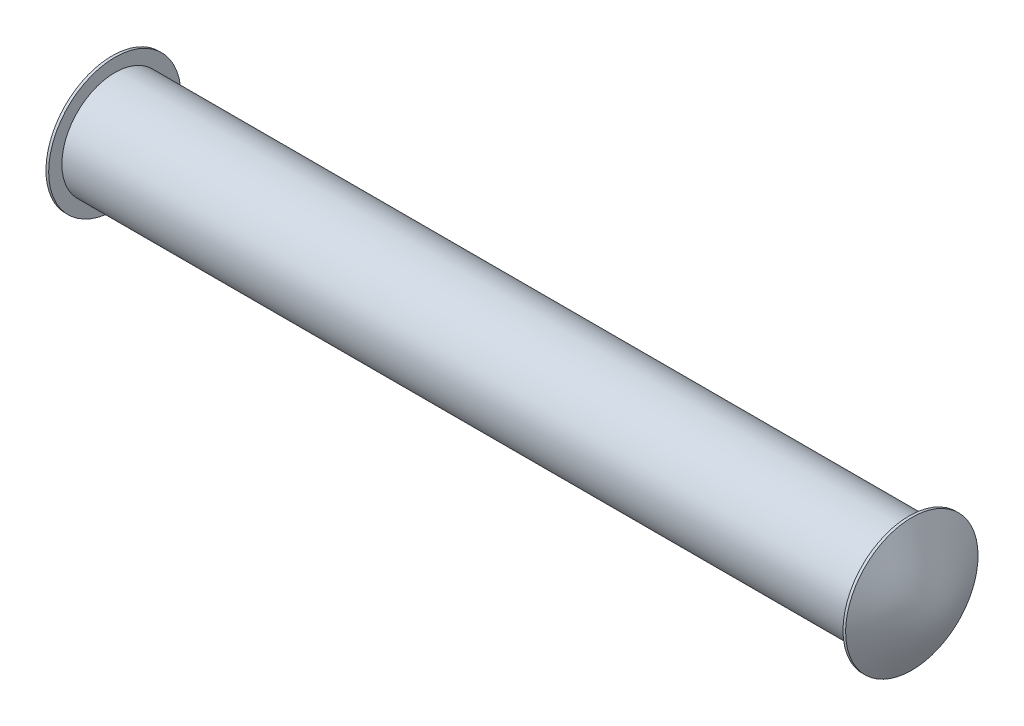
ISO-10303-21;
HEADER;
FILE_DESCRIPTION(('STEP AP214'),'2;1');
FILE_NAME('part.step','',(''),(''),'','','');
FILE_SCHEMA(('AUTOMOTIVE_DESIGN { 1 0 10303 214 1 1 1 1 }'));
ENDSEC;
DATA;
#1=APPLICATION_CONTEXT('core data for automotive mechanical design processes');
#2=APPLICATION_PROTOCOL_DEFINITION('international standard','automotive_design',2000,#1);
#3=PRODUCT_CONTEXT('',#1,'mechanical');
#4=PRODUCT('Part','Part','',(#3));
#5=PRODUCT_RELATED_PRODUCT_CATEGORY('part','',(#4));
#6=PRODUCT_DEFINITION_FORMATION('','',#4);
#7=PRODUCT_DEFINITION_CONTEXT('part definition',#1,'design');
#8=PRODUCT_DEFINITION('design','',#6,#7);
#9=PRODUCT_DEFINITION_SHAPE('','',#8);
#10=(LENGTH_UNIT() NAMED_UNIT(*) SI_UNIT(.MILLI.,.METRE.));
#11=(NAMED_UNIT(*) PLANE_ANGLE_UNIT() SI_UNIT($,.RADIAN.));
#12=(NAMED_UNIT(*) SI_UNIT($,.STERADIAN.) SOLID_ANGLE_UNIT());
#13=UNCERTAINTY_MEASURE_WITH_UNIT(LENGTH_MEASURE(1.E-05),#10,'distance_accuracy_value','');
#14=(GEOMETRIC_REPRESENTATION_CONTEXT(3) GLOBAL_UNCERTAINTY_ASSIGNED_CONTEXT((#13)) GLOBAL_UNIT_ASSIGNED_CONTEXT((#10,
#11,#12)) REPRESENTATION_CONTEXT('',''));
#15=CARTESIAN_POINT('',(0.,0.,0.));
#16=DIRECTION('',(0.,0.,1.));
#17=DIRECTION('',(1.,0.,0.));
#18=AXIS2_PLACEMENT_3D('',#15,#16,#17);
#19=CARTESIAN_POINT('',(3.,0.749999999997947,-0.049999999998232));
#20=DIRECTION('',(-1.,0.,0.));
#21=DIRECTION('',(0.,0.,1.));
#22=AXIS2_PLACEMENT_3D('',#19,#20,#21);
#23=CYLINDRICAL_SURFACE('',#22,0.199999999999999);
#24=CARTESIAN_POINT('',(3.,0.749999999997947,-0.049999999998232));
#25=DIRECTION('',(1.,0.,0.));
#26=DIRECTION('',(0.,0.,-1.));
#27=AXIS2_PLACEMENT_3D('',#24,#25,#26);
#28=CIRCLE('',#27,0.199999999999999);
#29=CARTESIAN_POINT('',(3.,0.749999999997947,-0.249999999998231));
#30=VERTEX_POINT('',#29);
#31=EDGE_CURVE('E12',#30,#30,#28,.T.);
#32=ORIENTED_EDGE('',*,*,#31,.F.);
#33=EDGE_LOOP('',(#32));
#34=FACE_BOUND('',#33,.T.);
#35=CARTESIAN_POINT('',(0.,0.749999999997947,-0.049999999998232));
#36=DIRECTION('',(-1.,0.,0.));
#37=DIRECTION('',(0.,0.,1.));
#38=AXIS2_PLACEMENT_3D('',#35,#36,#37);
#39=CIRCLE('',#38,0.199999999999999);
#40=CARTESIAN_POINT('',(0.,0.749999999997947,0.150000000001767));
#41=VERTEX_POINT('',#40);
#42=EDGE_CURVE('E140',#41,#41,#39,.T.);
#43=ORIENTED_EDGE('',*,*,#42,.F.);
#44=EDGE_LOOP('',(#43));
#45=FACE_BOUND('',#44,.T.);
#46=ADVANCED_FACE('F89',(#34,#45),#23,.T.);
#47=CARTESIAN_POINT('',(3.,0.749999999997947,-0.049999999998232));
#48=DIRECTION('',(1.,0.,0.));
#49=DIRECTION('',(0.,0.,-1.));
#50=AXIS2_PLACEMENT_3D('',#47,#48,#49);
#51=PLANE('',#50);
#52=CARTESIAN_POINT('',(3.,0.749999999997947,-0.049999999998232));
#53=DIRECTION('',(1.,0.,0.));
#54=DIRECTION('',(0.,0.,-1.));
#55=AXIS2_PLACEMENT_3D('',#52,#53,#54);
#56=CIRCLE('',#55,0.25);
#57=CARTESIAN_POINT('',(3.,0.749999999997947,-0.299999999998232));
#58=VERTEX_POINT('',#57);
#59=EDGE_CURVE('E108',#58,#58,#56,.T.);
#60=ORIENTED_EDGE('',*,*,#59,.F.);
#61=EDGE_LOOP('',(#60));
#62=FACE_BOUND('',#61,.T.);
#63=ORIENTED_EDGE('',*,*,#31,.T.);
#64=EDGE_LOOP('',(#63));
#65=FACE_BOUND('',#64,.T.);
#66=ADVANCED_FACE('F131',(#62,#65),#51,.F.);
#67=CARTESIAN_POINT('',(3.01,0.749999999997947,-0.049999999998232));
#68=DIRECTION('',(-1.,0.,0.));
#69=DIRECTION('',(0.,0.,1.));
#70=AXIS2_PLACEMENT_3D('',#67,#68,#69);
#71=CYLINDRICAL_SURFACE('',#70,0.25);
#72=CARTESIAN_POINT('',(3.01010566091061,0.750000000089704,0.200000000001768));
#73=CARTESIAN_POINT('',(3.01010621478674,0.735945178217187,0.200000583232357));
#74=CARTESIAN_POINT('',(3.01010785574931,0.721898030304428,0.198810311442465));
#75=CARTESIAN_POINT('',(3.01010506081937,0.694192800176074,0.194098659631233));
#76=CARTESIAN_POINT('',(3.01010061760914,0.68053520667522,0.190574475139788));
#77=CARTESIAN_POINT('',(3.01011669478687,0.640786354594318,0.176611622187771));
#78=CARTESIAN_POINT('',(3.01016634109076,0.615796343064439,0.162781785241891));
#79=CARTESIAN_POINT('',(3.01018912095916,0.571857923696763,0.127654051914844));
#80=CARTESIAN_POINT('',(3.01016225449396,0.552909518204964,0.106356152633783));
#81=CARTESIAN_POINT('',(3.01013036917123,0.52311593313974,0.0586826787305387));
#82=CARTESIAN_POINT('',(3.01012535011259,0.51227067897831,0.0323071508497955));
#83=CARTESIAN_POINT('',(3.01013460477031,0.49992575674459,-0.0225452144467428));
#84=CARTESIAN_POINT('',(3.01014887848036,0.498426085614127,-0.0510220511749194));
#85=CARTESIAN_POINT('',(3.01013795715021,0.50493640903098,-0.106867397566362));
#86=CARTESIAN_POINT('',(3.01011276183105,0.512946470793761,-0.134235899394424));
#87=CARTESIAN_POINT('',(3.01013515803647,0.537573363746154,-0.184779124882616));
#88=CARTESIAN_POINT('',(3.01018274938338,0.554190173927093,-0.207953858779352));
#89=CARTESIAN_POINT('',(3.01018674201579,0.594161864590233,-0.247494746761234));
#90=CARTESIAN_POINT('',(3.01014314294751,0.61751677121315,-0.263860874431515));
#91=CARTESIAN_POINT('',(3.01010279961869,0.668312901551385,-0.287947791843122));
#92=CARTESIAN_POINT('',(3.01010605523575,0.695754114592632,-0.295668604166911));
#93=CARTESIAN_POINT('',(3.0101068809253,0.751698939198766,-0.301562547747962));
#94=CARTESIAN_POINT('',(3.01010445099375,0.780202551521069,-0.299735672198266));
#95=CARTESIAN_POINT('',(3.01010462975243,0.821207541319957,-0.290064777640975));
#96=CARTESIAN_POINT('',(3.01010533219958,0.834610713918151,-0.285669297769323));
#97=CARTESIAN_POINT('',(3.01012368869417,0.86048634195667,-0.274697015727833));
#98=CARTESIAN_POINT('',(3.01014131908207,0.872960070227691,-0.268123266439212));
#99=CARTESIAN_POINT('',(3.01017014040505,0.896640038892363,-0.252965539734227));
#100=CARTESIAN_POINT('',(3.0101813223447,0.907844491262472,-0.244378777566755));
#101=CARTESIAN_POINT('',(3.01018684661399,0.928638133343685,-0.225458273133617));
#102=CARTESIAN_POINT('',(3.01018121243014,0.938229556145341,-0.215126986407762));
#103=CARTESIAN_POINT('',(3.01015938289471,0.95555496720969,-0.192986222715718));
#104=CARTESIAN_POINT('',(3.01014317287949,0.963286356087468,-0.181174711780634));
#105=CARTESIAN_POINT('',(3.0101203351773,0.976645633257463,-0.156438093320203));
#106=CARTESIAN_POINT('',(3.0101136941453,0.982276442901105,-0.14351456335652));
#107=CARTESIAN_POINT('',(3.01011936956584,0.991296447138331,-0.116887176652153));
#108=CARTESIAN_POINT('',(3.01013171268088,0.994682479465802,-0.103182248509498));
#109=CARTESIAN_POINT('',(3.01014647128551,0.999100899684703,-0.0754178459047175));
#110=CARTESIAN_POINT('',(3.01014890060578,1.00013656566484,-0.0613588929300445));
#111=CARTESIAN_POINT('',(3.01014765964732,0.999834333880446,-0.0332466676979674));
#112=CARTESIAN_POINT('',(3.01014398080948,0.998493105291444,-0.0191934310592389));
#113=CARTESIAN_POINT('',(3.01012860238559,0.993472298346034,0.00846852270833294));
#114=CARTESIAN_POINT('',(3.01011691400126,0.989795986232384,0.0220778328768407));
#115=CARTESIAN_POINT('',(3.01011459278555,0.980205477975834,0.0485053550565702));
#116=CARTESIAN_POINT('',(3.0101239893917,0.974288162672699,0.0613224353395313));
#117=CARTESIAN_POINT('',(3.0101490628406,0.96039415874009,0.085763136494849));
#118=CARTESIAN_POINT('',(3.01016473090579,0.952420353906865,0.097388396996903));
#119=CARTESIAN_POINT('',(3.01018388990754,0.934622875714898,0.119151551092097));
#120=CARTESIAN_POINT('',(3.01018736393647,0.924796653752137,0.129287360859388));
#121=CARTESIAN_POINT('',(3.01017784848213,0.903596146235492,0.147751323075115));
#122=CARTESIAN_POINT('',(3.01016488169343,0.892224013956493,0.156081948792797));
#123=CARTESIAN_POINT('',(3.01013513073978,0.868226518076786,0.17072658019329));
#124=CARTESIAN_POINT('',(3.01011834169732,0.855599564931738,0.177037984226775));
#125=CARTESIAN_POINT('',(3.01010317572358,0.82948551717557,0.187443998194885));
#126=CARTESIAN_POINT('',(3.0101047766739,0.815999475244774,0.191541264949164));
#127=CARTESIAN_POINT('',(3.0101059720278,0.785100679180972,0.198142948486241));
#128=CARTESIAN_POINT('',(3.01010496951781,0.767544360836691,0.199999271966368));
#129=CARTESIAN_POINT('',(3.01010566091061,0.750000000089704,0.200000000001768));
#130=B_SPLINE_CURVE_WITH_KNOTS('',3,(#72,#73,#74,#75,#76,#77,#78,#79,#80,#81,#82,#83,#84,#85,
#86,#87,#88,#89,#90,#91,#92,#93,#94,#95,#96,#97,#98,#99,#100,#101,#102,#103,#104,#105,#106,#107,
#108,#109,#110,#111,#112,#113,#114,#115,#116,#117,#118,#119,#120,#121,#122,#123,#124,#125,#126,
#127,#128,#129),.UNSPECIFIED.,.T.,.F.,(4,2,2,2,2,2,2,2,2,2,2,2,2,2,2,2,2,2,2,2,2,2,2,2,2,2,2,2,
4),(0.,0.0420957085666911,0.0842420920717373,0.168184740365063,0.252127421253864,
0.336069329456331,0.420011210190321,0.503953684234999,0.587895953380972,0.671838548188749,
0.755780923729215,0.839723359115821,0.881873931314667,0.923965676892425,0.966115998358524,
1.00820747746237,1.05035744181327,1.0924485661975,1.13459885996592,1.17669032990806,
1.21884083073079,1.26093250218405,1.3030829759096,1.34517466078607,1.38732468482736,
1.42941658908996,1.47156250992368,1.5136577454811,1.56620499963295),.UNSPECIFIED.);
#131=CARTESIAN_POINT('',(3.01010566091061,0.750000000089704,0.200000000001768));
#132=VERTEX_POINT('',#131);
#133=EDGE_CURVE('E103',#132,#132,#130,.T.);
#134=ORIENTED_EDGE('',*,*,#133,.F.);
#135=EDGE_LOOP('',(#134));
#136=FACE_BOUND('',#135,.T.);
#137=ORIENTED_EDGE('',*,*,#59,.T.);
#138=EDGE_LOOP('',(#137));
#139=FACE_BOUND('',#138,.T.);
#140=ADVANCED_FACE('F114',(#136,#139),#71,.T.);
#141=CARTESIAN_POINT('',(2.9503878004014,0.495093674660569,-0.316611208585007));
#142=CARTESIAN_POINT('',(2.96478519255763,0.495093674660569,-0.273953518913214));
#143=CARTESIAN_POINT('',(2.97787732809831,0.495093674660569,-0.231295829241422));
#144=CARTESIAN_POINT('',(2.99005571921114,0.495093674660569,-0.188638139569629));
#145=CARTESIAN_POINT('',(3.00411291594906,0.495093674660569,-0.12465151844212));
#146=CARTESIAN_POINT('',(3.00801787320673,0.495093674660569,-0.0606648973146105));
#147=CARTESIAN_POINT('',(3.00801790185835,0.495093674660569,-0.0393359658588937));
#148=CARTESIAN_POINT('',(3.00411307757205,0.495093674660569,0.0246508285082565));
#149=CARTESIAN_POINT('',(2.9900558082604,0.495093674660569,0.0886376228754068));
#150=CARTESIAN_POINT('',(2.97787721504711,0.495093674660569,0.13129548578684));
#151=CARTESIAN_POINT('',(2.96478503194713,0.495093674660569,0.173953348698274));
#152=CARTESIAN_POINT('',(2.95038765573647,0.495093674660569,0.216611211609707));
#153=CARTESIAN_POINT('',(2.96315484878732,0.535878587953932,-0.316611208585007));
#154=CARTESIAN_POINT('',(2.97983229757104,0.535878587953932,-0.273953518913214));
#155=CARTESIAN_POINT('',(2.99518621370561,0.535878587953932,-0.231295829241422));
#156=CARTESIAN_POINT('',(3.00971593341776,0.535878587953932,-0.188638139569629));
#157=CARTESIAN_POINT('',(3.02654857002032,0.535878587953932,-0.12465151844212));
#158=CARTESIAN_POINT('',(3.03122245260063,0.535878587953932,-0.0606648973146105));
#159=CARTESIAN_POINT('',(3.03122248069263,0.535878587953932,-0.0393359658588937));
#160=CARTESIAN_POINT('',(3.02654873512886,0.535878587953932,0.0246508285082565));
#161=CARTESIAN_POINT('',(3.00971604629732,0.535878587953932,0.0886376228754068));
#162=CARTESIAN_POINT('',(2.99518616479206,0.535878587953932,0.13129548578684));
#163=CARTESIAN_POINT('',(2.97983224940109,0.535878587953932,0.173953348698274));
#164=CARTESIAN_POINT('',(2.96315485194004,0.535878587953932,0.216611211609707));
#165=CARTESIAN_POINT('',(2.97472661101788,0.576663501247295,-0.316611208585007));
#166=CARTESIAN_POINT('',(2.99366786419773,0.576663501247295,-0.273953518913214));
#167=CARTESIAN_POINT('',(3.01124757612683,0.576663501247295,-0.231295829241422));
#168=CARTESIAN_POINT('',(3.02821874507743,0.576663501247295,-0.188638139569629));
#169=CARTESIAN_POINT('',(3.0479251806467,0.576663501247295,-0.12465151844212));
#170=CARTESIAN_POINT('',(3.05339366523572,0.576663501247295,-0.0606648973146105));
#171=CARTESIAN_POINT('',(3.05339369596168,0.576663501247295,-0.0393359658588937));
#172=CARTESIAN_POINT('',(3.04792535232646,0.576663501247295,0.0246508285082565));
#173=CARTESIAN_POINT('',(3.02821890486759,0.576663501247295,0.0886376228754068));
#174=CARTESIAN_POINT('',(3.01124760082065,0.576663501247295,0.13129548578684));
#175=CARTESIAN_POINT('',(2.99366793540668,0.576663501247295,0.173953348698274));
#176=CARTESIAN_POINT('',(2.97472678908443,0.576663501247295,0.216611211609707));
#177=CARTESIAN_POINT('',(2.98543717012414,0.617448414540659,-0.316611208585007));
#178=CARTESIAN_POINT('',(3.00673996827412,0.617448414540659,-0.273953518913214));
#179=CARTESIAN_POINT('',(3.02675578210582,0.617448414540659,-0.231295829241422));
#180=CARTESIAN_POINT('',(3.04648675892173,0.617448414540659,-0.188638139569629));
#181=CARTESIAN_POINT('',(3.06909991503299,0.617448414540659,-0.12465151844212));
#182=CARTESIAN_POINT('',(3.07544956999831,0.617448414540659,-0.0606648973146105));
#183=CARTESIAN_POINT('',(3.07544960377795,0.617448414540659,-0.0393359658588937));
#184=CARTESIAN_POINT('',(3.06910012638308,0.617448414540659,0.0246508285082565));
#185=CARTESIAN_POINT('',(3.04648698745537,0.617448414540659,0.0886376228754068));
#186=CARTESIAN_POINT('',(3.02675605461089,0.617448414540659,0.13129548578684));
#187=CARTESIAN_POINT('',(3.00674036539012,0.617448414540659,0.173953348698274));
#188=CARTESIAN_POINT('',(2.98543761525699,0.617448414540659,0.216611211609707));
#189=CARTESIAN_POINT('',(2.99769307833135,0.678625866726825,-0.316611208585007));
#190=CARTESIAN_POINT('',(3.02182492224242,0.678625866726825,-0.273953518913214));
#191=CARTESIAN_POINT('',(3.04478508313255,0.678625866726825,-0.231295829241422));
#192=CARTESIAN_POINT('',(3.06746923048572,0.678625866726825,-0.188638139569629));
#193=CARTESIAN_POINT('',(3.09547924580182,0.678625866726825,-0.12465151844212));
#194=CARTESIAN_POINT('',(3.10348702454894,0.678625866726825,-0.0606648973146105));
#195=CARTESIAN_POINT('',(3.10348706831505,0.678625866726825,-0.0393359658588937));
#196=CARTESIAN_POINT('',(3.09547951854053,0.678625866726825,0.0246508285082565));
#197=CARTESIAN_POINT('',(3.0674695560946,0.678625866726825,0.0886376228754068));
#198=CARTESIAN_POINT('',(3.04478538556563,0.678625866726825,0.13129548578684));
#199=CARTESIAN_POINT('',(3.02182510567527,0.678625866726825,0.173953348698274));
#200=CARTESIAN_POINT('',(2.99769315628263,0.678625866726825,0.216611211609707));
#201=CARTESIAN_POINT('',(3.00106932813699,0.739803318912992,-0.316611208585007));
#202=CARTESIAN_POINT('',(3.02599585792175,0.739803318912992,-0.273953518913214));
#203=CARTESIAN_POINT('',(3.04978951187148,0.739803318912992,-0.231295829241422));
#204=CARTESIAN_POINT('',(3.07337313196677,0.739803318912992,-0.188638139569629));
#205=CARTESIAN_POINT('',(3.10304681034421,0.739803318912992,-0.12465151844212));
#206=CARTESIAN_POINT('',(3.112266261174,0.739803318912992,-0.0606648973146105));
#207=CARTESIAN_POINT('',(3.11226631503549,0.739803318912992,-0.0393359658588937));
#208=CARTESIAN_POINT('',(3.10304710461681,0.739803318912992,0.0246508285082565));
#209=CARTESIAN_POINT('',(3.0733734294141,0.739803318912992,0.0886376228754068));
#210=CARTESIAN_POINT('',(3.04978972286767,0.739803318912992,0.13129548578684));
#211=CARTESIAN_POINT('',(3.02599594146898,0.739803318912992,0.173953348698274));
#212=CARTESIAN_POINT('',(3.00106930267721,0.739803318912992,0.216611211609707));
#213=CARTESIAN_POINT('',(3.00106929613553,0.760195857805795,-0.316611208585007));
#214=CARTESIAN_POINT('',(3.0259958479661,0.760195857805795,-0.273953518913214));
#215=CARTESIAN_POINT('',(3.04978956417389,0.760195857805795,-0.231295829241422));
#216=CARTESIAN_POINT('',(3.07337316780753,0.760195857805795,-0.188638139569629));
#217=CARTESIAN_POINT('',(3.10304685283146,0.760195857805795,-0.12465151844212));
#218=CARTESIAN_POINT('',(3.11226631235189,0.760195857805795,-0.0606648973146105));
#219=CARTESIAN_POINT('',(3.11226636625746,0.760195857805795,-0.0393359658588937));
#220=CARTESIAN_POINT('',(3.10304714390681,0.760195857805795,0.0246508285082565));
#221=CARTESIAN_POINT('',(3.07337345182608,0.760195857805795,0.0886376228754068));
#222=CARTESIAN_POINT('',(3.04978973309089,0.760195857805795,0.13129548578684));
#223=CARTESIAN_POINT('',(3.0259959592993,0.760195857805795,0.173953348698274));
#224=CARTESIAN_POINT('',(3.00106931504512,0.760195857805795,0.216611211609707));
#225=CARTESIAN_POINT('',(2.99769319257622,0.821373474484205,-0.316611208585007));
#226=CARTESIAN_POINT('',(3.02182511024694,0.821373474484205,-0.273953518913214));
#227=CARTESIAN_POINT('',(3.04478535499775,0.821373474484205,-0.231295829241422));
#228=CARTESIAN_POINT('',(3.06746946911638,0.821373474484205,-0.188638139569629));
#229=CARTESIAN_POINT('',(3.09547950114402,0.821373474484205,-0.12465151844212));
#230=CARTESIAN_POINT('',(3.10348730364901,0.821373474484205,-0.0606648973146105));
#231=CARTESIAN_POINT('',(3.10348734468676,0.821373474484205,-0.0393359658588937));
#232=CARTESIAN_POINT('',(3.09547977092929,0.821373474484205,0.0246508285082565));
#233=CARTESIAN_POINT('',(3.0674697065971,0.821373474484205,0.0886376228754068));
#234=CARTESIAN_POINT('',(3.04478541756994,0.821373474484205,0.13129548578684));
#235=CARTESIAN_POINT('',(3.02182511922908,0.821373474484205,0.173953348698274));
#236=CARTESIAN_POINT('',(2.99769311387466,0.821373474484205,0.216611211609707));
#237=CARTESIAN_POINT('',(2.98543774018658,0.882551091162615,-0.316611208585007));
#238=CARTESIAN_POINT('',(3.00674044840595,0.882551091162615,-0.273953518913214));
#239=CARTESIAN_POINT('',(3.02675609477143,0.882551091162615,-0.231295829241422));
#240=CARTESIAN_POINT('',(3.04648696671887,0.882551091162615,-0.188638139569629));
#241=CARTESIAN_POINT('',(3.06910018078134,0.882551091162615,-0.12465151844212));
#242=CARTESIAN_POINT('',(3.07544984168704,0.882551091162615,-0.0606648973146105));
#243=CARTESIAN_POINT('',(3.07544987831918,0.882551091162615,-0.0393359658588937));
#244=CARTESIAN_POINT('',(3.06910039100854,0.882551091162615,0.0246508285082565));
#245=CARTESIAN_POINT('',(3.0464872271612,0.882551091162615,0.0886376228754067));
#246=CARTESIAN_POINT('',(3.02675614382329,0.882551091162615,0.13129548578684));
#247=CARTESIAN_POINT('',(3.00674022294455,0.882551091162615,0.173953348698274));
#248=CARTESIAN_POINT('',(2.98543729872944,0.882551091162615,0.216611211609707));
#249=CARTESIAN_POINT('',(2.97472688339662,0.923336168948221,-0.316611208585007));
#250=CARTESIAN_POINT('',(2.99366797794918,0.923336168948221,-0.273953518913214));
#251=CARTESIAN_POINT('',(3.01124759610734,0.923336168948221,-0.231295829241422));
#252=CARTESIAN_POINT('',(3.02821884671139,0.923336168948221,-0.188638139569629));
#253=CARTESIAN_POINT('',(3.0479253378766,0.923336168948221,-0.12465151844212));
#254=CARTESIAN_POINT('',(3.05339384619102,0.923336168948221,-0.0606648973146105));
#255=CARTESIAN_POINT('',(3.05339387364025,0.923336168948221,-0.0393359658588937));
#256=CARTESIAN_POINT('',(3.04792553637146,0.923336168948221,0.0246508285082565));
#257=CARTESIAN_POINT('',(3.02821910481061,0.923336168948221,0.0886376228754068));
#258=CARTESIAN_POINT('',(3.01124785100872,0.923336168948221,0.13129548578684));
#259=CARTESIAN_POINT('',(2.993668057516,0.923336168948221,0.173953348698274));
#260=CARTESIAN_POINT('',(2.97472670729226,0.923336168948221,0.216611211609707));
#261=CARTESIAN_POINT('',(2.96315491348892,0.964121246733828,-0.316611208585007));
#262=CARTESIAN_POINT('',(2.97983225519394,0.964121246733828,-0.273953518913214));
#263=CARTESIAN_POINT('',(2.99518611974313,0.964121246733828,-0.231295829241422));
#264=CARTESIAN_POINT('',(3.00971594551552,0.964121246733828,-0.188638139569629));
#265=CARTESIAN_POINT('',(3.02654866796346,0.964121246733828,-0.12465151844212));
#266=CARTESIAN_POINT('',(3.03122254903032,0.964121246733828,-0.0606648973146105));
#267=CARTESIAN_POINT('',(3.03122257181967,0.964121246733828,-0.0393359658588937));
#268=CARTESIAN_POINT('',(3.02654881781863,0.964121246733828,0.0246508285082565));
#269=CARTESIAN_POINT('',(3.00971619108,0.964121246733828,0.0886376228754068));
#270=CARTESIAN_POINT('',(2.9951864099144,0.964121246733828,0.13129548578684));
#271=CARTESIAN_POINT('',(2.97983243397128,0.964121246733828,0.173953348698274));
#272=CARTESIAN_POINT('',(2.9631549103442,0.964121246733828,0.216611211609707));
#273=CARTESIAN_POINT('',(2.95038767170208,1.00490632451943,-0.316611208585007));
#274=CARTESIAN_POINT('',(2.96478498813802,1.00490632451943,-0.273953518913214));
#275=CARTESIAN_POINT('',(2.97787711678445,1.00490632451943,-0.231295829241422));
#276=CARTESIAN_POINT('',(2.99005565587774,1.00490632451943,-0.188638139569629));
#277=CARTESIAN_POINT('',(3.00411294417555,1.00490632451943,-0.12465151844212));
#278=CARTESIAN_POINT('',(3.00801788014052,1.00490632451943,-0.0606648973146105));
#279=CARTESIAN_POINT('',(3.00801789405711,1.00490632451943,-0.0393359658588937));
#280=CARTESIAN_POINT('',(3.00411304650822,1.00490632451943,0.0246508285082565));
#281=CARTESIAN_POINT('',(2.99005586658508,1.00490632451943,0.0886376228754068));
#282=CARTESIAN_POINT('',(2.9778774337969,1.00490632451943,0.13129548578684));
#283=CARTESIAN_POINT('',(2.96478525888471,1.00490632451943,0.173953348698274));
#284=CARTESIAN_POINT('',(2.95038781414428,1.00490632451943,0.216611211609707));
#285=B_SPLINE_SURFACE_WITH_KNOTS('',5,5,((#141,#142,#143,#144,#145,#146,#147,#148,#149,#150,
#151,#152),(#153,#154,#155,#156,#157,#158,#159,#160,#161,#162,#163,#164),(#165,#166,#167,#168,
#169,#170,#171,#172,#173,#174,#175,#176),(#177,#178,#179,#180,#181,#182,#183,#184,#185,#186,
#187,#188),(#189,#190,#191,#192,#193,#194,#195,#196,#197,#198,#199,#200),(#201,#202,#203,#204,
#205,#206,#207,#208,#209,#210,#211,#212),(#213,#214,#215,#216,#217,#218,#219,#220,#221,#222,
#223,#224),(#225,#226,#227,#228,#229,#230,#231,#232,#233,#234,#235,#236),(#237,#238,#239,#240,
#241,#242,#243,#244,#245,#246,#247,#248),(#249,#250,#251,#252,#253,#254,#255,#256,#257,#258,
#259,#260),(#261,#262,#263,#264,#265,#266,#267,#268,#269,#270,#271,#272),(#273,#274,#275,#276,
#277,#278,#279,#280,#281,#282,#283,#284)),.UNSPECIFIED.,.F.,.F.,.F.,(6,3,3,6),(6,3,3,6),
(-0.254906326169742,-0.050981759702925,0.0509809347610911,0.254906323689123),
(-0.266611208610582,-0.053322760251619,0.0533218970269647,0.266611211584132),.UNSPECIFIED.);
#286=ORIENTED_EDGE('',*,*,#133,.T.);
#287=EDGE_LOOP('',(#286));
#288=FACE_BOUND('',#287,.T.);
#289=ADVANCED_FACE('F118',(#288),#285,.T.);
#290=CARTESIAN_POINT('',(0.,0.749999999997947,-0.049999999998232));
#291=DIRECTION('',(-1.,0.,0.));
#292=DIRECTION('',(0.,0.,1.));
#293=AXIS2_PLACEMENT_3D('',#290,#291,#292);
#294=PLANE('',#293);
#295=CARTESIAN_POINT('',(0.,0.749999999997947,-0.049999999998232));
#296=DIRECTION('',(-1.,0.,0.));
#297=DIRECTION('',(0.,0.,1.));
#298=AXIS2_PLACEMENT_3D('',#295,#296,#297);
#299=CIRCLE('',#298,0.25);
#300=CARTESIAN_POINT('',(0.,0.749999999997947,0.200000000001768));
#301=VERTEX_POINT('',#300);
#302=EDGE_CURVE('E144',#301,#301,#299,.T.);
#303=ORIENTED_EDGE('',*,*,#302,.F.);
#304=EDGE_LOOP('',(#303));
#305=FACE_BOUND('',#304,.T.);
#306=ORIENTED_EDGE('',*,*,#42,.T.);
#307=EDGE_LOOP('',(#306));
#308=FACE_BOUND('',#307,.T.);
#309=ADVANCED_FACE('F123',(#305,#308),#294,.F.);
#310=CARTESIAN_POINT('',(-0.01,0.749999999997947,-0.049999999998232));
#311=DIRECTION('',(1.,0.,0.));
#312=DIRECTION('',(0.,0.,-1.));
#313=AXIS2_PLACEMENT_3D('',#310,#311,#312);
#314=CYLINDRICAL_SURFACE('',#313,0.25);
#315=CARTESIAN_POINT('',(-0.0101056608739972,0.750000000089703,-0.299999999998231));
#316=CARTESIAN_POINT('',(-0.0101062147505975,0.735945178217424,-0.300000583228819));
#317=CARTESIAN_POINT('',(-0.0101078557021101,0.721898030304892,-0.298810311438967));
#318=CARTESIAN_POINT('',(-0.0101050607689873,0.694192800176971,-0.29409865962789));
#319=CARTESIAN_POINT('',(-0.0101006175666605,0.680535206676325,-0.290574475136558));
#320=CARTESIAN_POINT('',(-0.0101166948392985,0.640786354596021,-0.276611622184996));
#321=CARTESIAN_POINT('',(-0.0101663413008803,0.615796343066494,-0.262781785239574));
#322=CARTESIAN_POINT('',(-0.0101891209367594,0.57185792369901,-0.22765405191353));
#323=CARTESIAN_POINT('',(-0.0101622540813453,0.552909518207114,-0.206356152632938));
#324=CARTESIAN_POINT('',(-0.0101303690143837,0.523115933140741,-0.158682678729353));
#325=CARTESIAN_POINT('',(-0.0101253506017242,0.512270678978624,-0.132307150847573));
#326=CARTESIAN_POINT('',(-0.0101346053064423,0.499925756743574,-0.0774547855452982));
#327=CARTESIAN_POINT('',(-0.0101488784175096,0.498426085613648,-0.0489779488121561));
#328=CARTESIAN_POINT('',(-0.0101379568262364,0.504936409034159,0.00686739758365847));
#329=CARTESIAN_POINT('',(-0.0101127618449387,0.512946470798503,0.034235899411309));
#330=CARTESIAN_POINT('',(-0.0101351582623026,0.537573363751952,0.0847791248944325));
#331=CARTESIAN_POINT('',(-0.0101827494832863,0.554190173931115,0.10795385878713));
#332=CARTESIAN_POINT('',(-0.010186741965212,0.594161864590727,0.147494746764995));
#333=CARTESIAN_POINT('',(-0.0101431428723636,0.617516771212606,0.163860874434575));
#334=CARTESIAN_POINT('',(-0.0101027995754991,0.668312901551783,0.187947791847065));
#335=CARTESIAN_POINT('',(-0.0101060552490989,0.695754114595522,0.195668604171356));
#336=CARTESIAN_POINT('',(-0.0101068809992895,0.751698939204881,0.201562547751543));
#337=CARTESIAN_POINT('',(-0.0101044510718271,0.780202551527852,0.199735672201054));
#338=CARTESIAN_POINT('',(-0.0101046297833317,0.821207541327085,0.190064777642396));
#339=CARTESIAN_POINT('',(-0.0101053322057571,0.834610713925121,0.18566929777036));
#340=CARTESIAN_POINT('',(-0.0101236886283946,0.860486341963299,0.174697015728105));
#341=CARTESIAN_POINT('',(-0.010141318969101,0.872960070234139,0.168123266439105));
#342=CARTESIAN_POINT('',(-0.0101701402750847,0.896640038898397,0.152965539733415));
#343=CARTESIAN_POINT('',(-0.0101813222450287,0.90784449126826,0.144378777565601));
#344=CARTESIAN_POINT('',(-0.0101868466496142,0.92863813334898,0.12545827313176));
#345=CARTESIAN_POINT('',(-0.0101812125706603,0.938229556150392,0.115126986405548));
#346=CARTESIAN_POINT('',(-0.0101593831933236,0.955554967214911,0.0929862227118772));
#347=CARTESIAN_POINT('',(-0.0101431732312195,0.963286356092939,0.0811747117753973));
#348=CARTESIAN_POINT('',(-0.0101203352614949,0.97664563326296,0.0564380933122056));
#349=CARTESIAN_POINT('',(-0.0101136939093691,0.982276442906378,0.0435145633471602));
#350=CARTESIAN_POINT('',(-0.0101193690881588,0.991296447143098,0.0168871766389448));
#351=CARTESIAN_POINT('',(-0.0101317122821477,0.994682479470119,0.00318224849374747));
#352=CARTESIAN_POINT('',(-0.0101464710662918,0.99910089968732,-0.0245821541160149));
#353=CARTESIAN_POINT('',(-0.0101489004871063,1.0001365656662,-0.0386411070931308));
#354=CARTESIAN_POINT('',(-0.0101476597926826,0.999834333878497,-0.0667533323268383));
#355=CARTESIAN_POINT('',(-0.0101439811184166,0.998493105287978,-0.0808065689647597));
#356=CARTESIAN_POINT('',(-0.0101286028322495,0.993472298339852,-0.108468522730431));
#357=CARTESIAN_POINT('',(-0.0101169144223209,0.989795986224985,-0.122077832897843));
#358=CARTESIAN_POINT('',(-0.0101145929073881,0.980205477965454,-0.148505355077482));
#359=CARTESIAN_POINT('',(-0.0101239892395633,0.974288162660215,-0.161322435361325));
#360=CARTESIAN_POINT('',(-0.0101490624894616,0.960394158723191,-0.185763136517676));
#361=CARTESIAN_POINT('',(-0.0101647306291376,0.952420353887659,-0.197388397019883));
#362=CARTESIAN_POINT('',(-0.0101838898054887,0.934622875693174,-0.219151551112086));
#363=CARTESIAN_POINT('',(-0.0101873639345777,0.92479665373067,-0.229287360876617));
#364=CARTESIAN_POINT('',(-0.0101778485974794,0.90359614621521,-0.247751323087176));
#365=CARTESIAN_POINT('',(-0.010164881825991,0.892224013937145,-0.256081948802459));
#366=CARTESIAN_POINT('',(-0.0101351308400233,0.868226518059374,-0.270726580198988));
#367=CARTESIAN_POINT('',(-0.0101183417479709,0.855599564915267,-0.277037984230809));
#368=CARTESIAN_POINT('',(-0.0101031757025886,0.829485517161242,-0.287443998196051));
#369=CARTESIAN_POINT('',(-0.0101047766308437,0.815999475231647,-0.291541264949125));
#370=CARTESIAN_POINT('',(-0.0101059719720558,0.785100679172917,-0.298142948483566));
#371=CARTESIAN_POINT('',(-0.0101049694806112,0.767544360832674,-0.299999271962835));
#372=CARTESIAN_POINT('',(-0.0101056608739972,0.750000000089703,-0.299999999998231));
#373=B_SPLINE_CURVE_WITH_KNOTS('',3,(#315,#316,#317,#318,#319,#320,#321,#322,#323,#324,#325,
#326,#327,#328,#329,#330,#331,#332,#333,#334,#335,#336,#337,#338,#339,#340,#341,#342,#343,#344,
#345,#346,#347,#348,#349,#350,#351,#352,#353,#354,#355,#356,#357,#358,#359,#360,#361,#362,#363,
#364,#365,#366,#367,#368,#369,#370,#371,#372),.UNSPECIFIED.,.T.,.F.,(4,2,2,2,2,2,2,2,2,2,2,2,2,
2,2,2,2,2,2,2,2,2,2,2,2,2,2,2,4),(0.,0.0420957085660014,0.0842420920703622,0.16818474036228,
0.252127421250527,0.336069329456212,0.420011210204025,0.503953684248777,0.58789595338244,
0.671838548186802,0.755780923734357,0.839723359123014,0.881873931321783,0.923965676899412,
0.966115998365722,1.0082074774697,1.05035744182441,1.09244856621242,1.13459885998772,
1.17669032993698,1.2188408307575,1.26093250220884,1.30308297593887,1.34517466081975,
1.38732468485472,1.42941658911077,1.47156250993997,1.51365774549292,1.56620499963277),.UNSPECIFIED.);
#374=CARTESIAN_POINT('',(-0.0101056608739972,0.750000000089703,-0.299999999998231));
#375=VERTEX_POINT('',#374);
#376=EDGE_CURVE('E96',#375,#375,#373,.T.);
#377=ORIENTED_EDGE('',*,*,#376,.F.);
#378=EDGE_LOOP('',(#377));
#379=FACE_BOUND('',#378,.T.);
#380=ORIENTED_EDGE('',*,*,#302,.T.);
#381=EDGE_LOOP('',(#380));
#382=FACE_BOUND('',#381,.T.);
#383=ADVANCED_FACE('F149',(#379,#382),#314,.T.);
#384=CARTESIAN_POINT('',(0.0496123426020449,0.495093674660568,-0.31661121160618));
#385=CARTESIAN_POINT('',(0.0352150239389091,0.495093674660568,-0.273953521934518));
#386=CARTESIAN_POINT('',(0.022122888602138,0.495093674660568,-0.231295832262855));
#387=CARTESIAN_POINT('',(0.00994434304113647,0.495093674660568,-0.188638142591193));
#388=CARTESIAN_POINT('',(-0.00411294527446111,0.495093674660568,-0.124651521463709));
#389=CARTESIAN_POINT('',(-0.00801788057439355,0.495093674660568,-0.0606649003362257));
#390=CARTESIAN_POINT('',(-0.00801789449117205,0.495093674660568,-0.0393359688804044));
#391=CARTESIAN_POINT('',(-0.00411304824619351,0.495093674660568,0.0246508254870595));
#392=CARTESIAN_POINT('',(0.00994412948939984,0.495093674660568,0.0886376198545233));
#393=CARTESIAN_POINT('',(0.0221225682526274,0.495093674660568,0.131295482766166));
#394=CARTESIAN_POINT('',(0.0352147515562044,0.495093674660568,0.173953345677808));
#395=CARTESIAN_POINT('',(0.0496122012602665,0.495093674660568,0.216611208589451));
#396=CARTESIAN_POINT('',(0.0368451472410342,0.535878587953931,-0.31661121160618));
#397=CARTESIAN_POINT('',(0.0201678165026619,0.535878587953931,-0.273953521934518));
#398=CARTESIAN_POINT('',(0.00481395733547167,0.535878587953931,-0.231295832262855));
#399=CARTESIAN_POINT('',(-0.00971586541307209,0.535878587953931,-0.188638142591193));
#400=CARTESIAN_POINT('',(-0.0265485769572658,0.535878587953931,-0.124651521463709));
#401=CARTESIAN_POINT('',(-0.03122245516981,0.535878587953931,-0.0606649003362257));
#402=CARTESIAN_POINT('',(-0.0312224781236266,0.535878587953931,-0.0393359688804044));
#403=CARTESIAN_POINT('',(-0.0265487281914629,0.535878587953931,0.0246508254870595));
#404=CARTESIAN_POINT('',(-0.00971611430041051,0.535878587953931,0.0886376198545233));
#405=CARTESIAN_POINT('',(0.00481366416660169,0.535878587953931,0.131295482766166));
#406=CARTESIAN_POINT('',(0.020167636524971,0.535878587953931,0.173953345677808));
#407=CARTESIAN_POINT('',(0.0368451520318449,0.535878587953931,0.216611208589451));
#408=CARTESIAN_POINT('',(0.0252732109301962,0.576663501247295,-0.31661121160618));
#409=CARTESIAN_POINT('',(0.00633214031165184,0.576663501247295,-0.273953521934518));
#410=CARTESIAN_POINT('',(-0.0112474595647389,0.576663501247295,-0.231295832262855));
#411=CARTESIAN_POINT('',(-0.0282186942181944,0.576663501247295,-0.188638142591193));
#412=CARTESIAN_POINT('',(-0.0479251661396976,0.576663501247295,-0.124651521463709));
#413=CARTESIAN_POINT('',(-0.053393666736022,0.576663501247295,-0.0606649003362257));
#414=CARTESIAN_POINT('',(-0.0533936944613576,0.576663501247295,-0.0393359688804044));
#415=CARTESIAN_POINT('',(-0.0479253668330249,0.576663501247295,0.0246508254870595));
#416=CARTESIAN_POINT('',(-0.0282189557259018,0.576663501247295,0.0886376198545233));
#417=CARTESIAN_POINT('',(-0.0112477173831544,0.576663501247295,0.131295482766166));
#418=CARTESIAN_POINT('',(0.00633206008344489,0.576663501247295,0.173953345677808));
#419=CARTESIAN_POINT('',(0.0252733889677597,0.576663501247295,0.216611208589451));
#420=CARTESIAN_POINT('',(0.0145623854309901,0.617448414540658,-0.31661121160618));
#421=CARTESIAN_POINT('',(-0.00674027933457508,0.617448414540658,-0.273953521934518));
#422=CARTESIAN_POINT('',(-0.0267558931031074,0.617448414540658,-0.231295832262855));
#423=CARTESIAN_POINT('',(-0.0464867413591008,0.617448414540658,-0.188638142591193));
#424=CARTESIAN_POINT('',(-0.0690999144640003,0.617448414540658,-0.124651521463709));
#425=CARTESIAN_POINT('',(-0.075449568391105,0.617448414540658,-0.0606649003362257));
#426=CARTESIAN_POINT('',(-0.0754496053851306,0.617448414540658,-0.0393359688804044));
#427=CARTESIAN_POINT('',(-0.0691001269519307,0.617448414540658,0.0246508254870595));
#428=CARTESIAN_POINT('',(-0.0464870050183519,0.617448414540658,0.0886376198545233));
#429=CARTESIAN_POINT('',(-0.0267559436153437,0.617448414540658,0.131295482766166));
#430=CARTESIAN_POINT('',(-0.00674005432993487,0.617448414540658,0.173953345677808));
#431=CARTESIAN_POINT('',(0.0145628291881484,0.617448414540658,0.216611208589451));
#432=CARTESIAN_POINT('',(0.00230684424817853,0.678625866726825,-0.31661121160618));
#433=CARTESIAN_POINT('',(-0.0218250081044747,0.678625866726825,-0.273953521934518));
#434=CARTESIAN_POINT('',(-0.0447852007273283,0.678625866726825,-0.231295832262855));
#435=CARTESIAN_POINT('',(-0.0674692725482258,0.678625866726825,-0.188638142591193));
#436=CARTESIAN_POINT('',(-0.0954792458246862,0.678625866726825,-0.124651521463709));
#437=CARTESIAN_POINT('',(-0.103487025707724,0.678625866726825,-0.0606649003362257));
#438=CARTESIAN_POINT('',(-0.103487067156347,0.678625866726825,-0.0393359688804044));
#439=CARTESIAN_POINT('',(-0.0954795185177822,0.678625866726825,0.0246508254870595));
#440=CARTESIAN_POINT('',(-0.0674695140326132,0.678625866726825,0.0886376198545233));
#441=CARTESIAN_POINT('',(-0.0447852679702377,0.678625866726825,0.131295482766166));
#442=CARTESIAN_POINT('',(-0.0218250198128708,0.678625866726825,0.173953345677808));
#443=CARTESIAN_POINT('',(0.00230692113818526,0.678625866726825,0.216611208589451));
#444=CARTESIAN_POINT('',(-0.00106930236650094,0.739803318912992,-0.31661121160618));
#445=CARTESIAN_POINT('',(-0.0259958408563113,0.739803318912992,-0.273953521934518));
#446=CARTESIAN_POINT('',(-0.0497895305325485,0.739803318912992,-0.231295832262855));
#447=CARTESIAN_POINT('',(-0.0733731363238754,0.739803318912992,-0.188638142591193));
#448=CARTESIAN_POINT('',(-0.103046810388711,0.739803318912992,-0.124651521463709));
#449=CARTESIAN_POINT('',(-0.112266260894897,0.739803318912992,-0.0606649003362257));
#450=CARTESIAN_POINT('',(-0.112266315314624,0.739803318912992,-0.0393359688804044));
#451=CARTESIAN_POINT('',(-0.103047104572234,0.739803318912992,0.0246508254870595));
#452=CARTESIAN_POINT('',(-0.0733734250568167,0.739803318912992,0.0886376198545233));
#453=CARTESIAN_POINT('',(-0.0497897042059257,0.739803318912992,0.131295482766166));
#454=CARTESIAN_POINT('',(-0.0259959585339334,0.739803318912992,0.173953345677808));
#455=CARTESIAN_POINT('',(-0.0010693284471984,0.739803318912992,0.216611208589451));
#456=CARTESIAN_POINT('',(-0.00106931473438863,0.760195857805795,-0.31661121160618));
#457=CARTESIAN_POINT('',(-0.0259958586865772,0.760195857805795,-0.273953521934518));
#458=CARTESIAN_POINT('',(-0.049789540755871,0.760195857805795,-0.231295832262855));
#459=CARTESIAN_POINT('',(-0.0733731587356572,0.760195857805795,-0.188638142591193));
#460=CARTESIAN_POINT('',(-0.103046849678572,0.760195857805795,-0.124651521463709));
#461=CARTESIAN_POINT('',(-0.112266312116698,0.760195857805795,-0.0606649003362257));
#462=CARTESIAN_POINT('',(-0.112266366492639,0.760195857805795,-0.0393359688804044));
#463=CARTESIAN_POINT('',(-0.103047147059566,0.760195857805795,0.0246508254870595));
#464=CARTESIAN_POINT('',(-0.0733734608974869,0.760195857805795,0.0886376198545233));
#465=CARTESIAN_POINT('',(-0.0497897565087592,0.760195857805795,0.131295482766166));
#466=CARTESIAN_POINT('',(-0.0259959485783482,0.760195857805795,0.173953345677808));
#467=CARTESIAN_POINT('',(-0.0010692964456951,0.760195857805795,0.216611208589451));
#468=CARTESIAN_POINT('',(0.0023068866562922,0.821373474484205,-0.31661121160618));
#469=CARTESIAN_POINT('',(-0.021825021657943,0.821373474484205,-0.273953521934518));
#470=CARTESIAN_POINT('',(-0.0447852327313447,0.821373474484205,-0.231295832262855));
#471=CARTESIAN_POINT('',(-0.0674694230494909,0.821373474484205,-0.188638142591193));
#472=CARTESIAN_POINT('',(-0.0954794982124514,0.821373474484205,-0.124651521463709));
#473=CARTESIAN_POINT('',(-0.10348730207926,0.821373474484205,-0.0606649003362257));
#474=CARTESIAN_POINT('',(-0.103487346256413,0.821373474484205,-0.0393359688804044));
#475=CARTESIAN_POINT('',(-0.0954797738605218,0.821373474484205,0.0246508254870595));
#476=CARTESIAN_POINT('',(-0.0674697526628288,0.821373474484205,0.0886376198545233));
#477=CARTESIAN_POINT('',(-0.0447855398361782,0.821373474484205,0.131295482766166));
#478=CARTESIAN_POINT('',(-0.021825207817496,0.821373474484205,0.173953345677808));
#479=CARTESIAN_POINT('',(0.00230680689351913,0.821373474484205,0.216611208589451));
#480=CARTESIAN_POINT('',(0.0145627019587335,0.882551091162614,-0.31661121160618));
#481=CARTESIAN_POINT('',(-0.00674013688813118,0.882551091162614,-0.273953521934518));
#482=CARTESIAN_POINT('',(-0.0267559823132574,0.882551091162614,-0.231295832262855));
#483=CARTESIAN_POINT('',(-0.0464869810638297,0.882551091162614,-0.188638142591193));
#484=CARTESIAN_POINT('',(-0.0691001790891814,0.882551091162614,-0.124651521463709));
#485=CARTESIAN_POINT('',(-0.0754498429322469,0.882551091162614,-0.0606649003362257));
#486=CARTESIAN_POINT('',(-0.075449877073911,0.882551091162614,-0.0393359688804044));
#487=CARTESIAN_POINT('',(-0.0691003927005999,0.882551091162614,0.0246508254870595));
#488=CARTESIAN_POINT('',(-0.0464872128153013,0.882551091162614,0.0886376198545233));
#489=CARTESIAN_POINT('',(-0.0267562562790185,0.882551091162614,0.131295482766166));
#490=CARTESIAN_POINT('',(-0.00674053446130185,0.882551091162614,0.173953345677808));
#491=CARTESIAN_POINT('',(0.0145622591258805,0.882551091162614,0.216611208589451));
#492=CARTESIAN_POINT('',(0.0252732927224955,0.923336168948221,-0.31661121160618));
#493=CARTESIAN_POINT('',(0.00633201820324396,0.923336168948221,-0.273953521934518));
#494=CARTESIAN_POINT('',(-0.0112477097518983,0.923336168948221,-0.231295832262855));
#495=CARTESIAN_POINT('',(-0.0282188941617209,0.923336168948221,-0.188638142591193));
#496=CARTESIAN_POINT('',(-0.0479253501847768,0.923336168948221,-0.124651521463709));
#497=CARTESIAN_POINT('',(-0.0533938444145399,0.923336168948221,-0.0606649003362257));
#498=CARTESIAN_POINT('',(-0.0533938754166564,0.923336168948221,-0.0393359688804044));
#499=CARTESIAN_POINT('',(-0.0479255240634918,0.923336168948221,0.0246508254870595));
#500=CARTESIAN_POINT('',(-0.0282190573606774,0.923336168948221,0.0886376198545233));
#501=CARTESIAN_POINT('',(-0.0112477373631397,0.923336168948221,0.131295482766166));
#502=CARTESIAN_POINT('',(0.00633194633277272,0.923336168948221,0.173953345677808));
#503=CARTESIAN_POINT('',(0.0252731165891328,0.923336168948221,0.216611208589451));
#504=CARTESIAN_POINT('',(0.0368450888369399,0.964121246733827,-0.31661121160618));
#505=CARTESIAN_POINT('',(0.0201676319330193,0.964121246733827,-0.273953521934518));
#506=CARTESIAN_POINT('',(0.00481371221364368,0.964121246733827,-0.231295832262855));
#507=CARTESIAN_POINT('',(-0.00971601019705402,0.964121246733827,-0.188638142591193));
#508=CARTESIAN_POINT('',(-0.0265486596473003,0.964121246733827,-0.124651521463709));
#509=CARTESIAN_POINT('',(-0.0312225462966269,0.964121246733827,-0.0606649003362257));
#510=CARTESIAN_POINT('',(-0.0312225745531384,0.964121246733827,-0.0393359688804044));
#511=CARTESIAN_POINT('',(-0.0265488261350633,0.964121246733827,0.0246508254870595));
#512=CARTESIAN_POINT('',(-0.00971612639963599,0.964121246733827,0.0886376198545233));
#513=CARTESIAN_POINT('',(0.00481375812958522,0.964121246733827,0.131295482766166));
#514=CARTESIAN_POINT('',(0.0201676789025488,0.964121246733827,0.173953345677808));
#515=CARTESIAN_POINT('',(0.0368450873303263,0.964121246733827,0.216611208589451));
#516=CARTESIAN_POINT('',(0.0496121841942726,1.00490632451943,-0.31661121160618));
#517=CARTESIAN_POINT('',(0.0352147970016271,1.00490632451943,-0.273953521934518));
#518=CARTESIAN_POINT('',(0.0221226698522506,1.00490632451943,-0.231295832262855));
#519=CARTESIAN_POINT('',(0.00994428471448029,1.00490632451943,-0.188638142591193));
#520=CARTESIAN_POINT('',(-0.00411291421102583,1.00490632451943,-0.124651521463709));
#521=CARTESIAN_POINT('',(-0.00801787277267852,1.00490632451943,-0.0606649003362257));
#522=CARTESIAN_POINT('',(-0.00801790142448948,1.00490632451943,-0.0393359688804044));
#523=CARTESIAN_POINT('',(-0.00411307647311103,1.00490632451943,0.0246508254870595));
#524=CARTESIAN_POINT('',(0.00994419282092626,1.00490632451943,0.0886376198545233));
#525=CARTESIAN_POINT('',(0.0221227795665648,1.00490632451943,0.131295482766166));
#526=CARTESIAN_POINT('',(0.035214955976175,1.00490632451943,0.173953345677808));
#527=CARTESIAN_POINT('',(0.0496123299596425,1.00490632451943,0.216611208589451));
#528=B_SPLINE_SURFACE_WITH_KNOTS('',5,5,((#384,#385,#386,#387,#388,#389,#390,#391,#392,#393,
#394,#395),(#396,#397,#398,#399,#400,#401,#402,#403,#404,#405,#406,#407),(#408,#409,#410,#411,
#412,#413,#414,#415,#416,#417,#418,#419),(#420,#421,#422,#423,#424,#425,#426,#427,#428,#429,
#430,#431),(#432,#433,#434,#435,#436,#437,#438,#439,#440,#441,#442,#443),(#444,#445,#446,#447,
#448,#449,#450,#451,#452,#453,#454,#455),(#456,#457,#458,#459,#460,#461,#462,#463,#464,#465,
#466,#467),(#468,#469,#470,#471,#472,#473,#474,#475,#476,#477,#478,#479),(#480,#481,#482,#483,
#484,#485,#486,#487,#488,#489,#490,#491),(#492,#493,#494,#495,#496,#497,#498,#499,#500,#501,
#502,#503),(#504,#505,#506,#507,#508,#509,#510,#511,#512,#513,#514,#515),(#516,#517,#518,#519,
#520,#521,#522,#523,#524,#525,#526,#527)),.UNSPECIFIED.,.F.,.F.,.F.,(6,3,3,6),(6,3,3,6),
(-0.254906326169742,-0.0509817597029253,0.0509809347610908,0.254906323689123),
(-0.266611211584141,-0.053322763225829,0.0533218940532774,0.26661120861149),.UNSPECIFIED.);
#529=ORIENTED_EDGE('',*,*,#376,.T.);
#530=EDGE_LOOP('',(#529));
#531=FACE_BOUND('',#530,.T.);
#532=ADVANCED_FACE('F91',(#531),#528,.F.);
#533=CLOSED_SHELL('',(#46,#66,#140,#289,#309,#383,#532));
#534=MANIFOLD_SOLID_BREP('B2',#533);
#535=ADVANCED_BREP_SHAPE_REPRESENTATION('',(#18,#534),#14);
#536=SHAPE_DEFINITION_REPRESENTATION(#9,#535);
ENDSEC;
END-ISO-10303-21;
